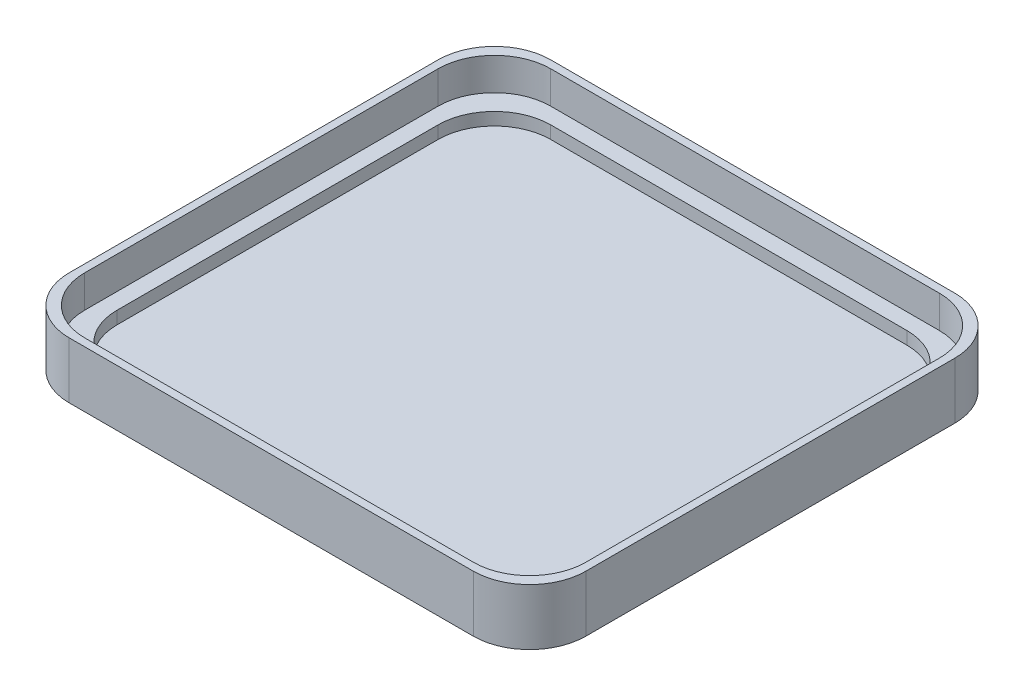
ISO-10303-21;
HEADER;
FILE_DESCRIPTION(('STEP AP214'),'2;1');
FILE_NAME('part.step','',(''),(''),'','','');
FILE_SCHEMA(('AUTOMOTIVE_DESIGN { 1 0 10303 214 1 1 1 1 }'));
ENDSEC;
DATA;
#1=APPLICATION_CONTEXT('core data for automotive mechanical design processes');
#2=APPLICATION_PROTOCOL_DEFINITION('international standard','automotive_design',2000,#1);
#3=PRODUCT_CONTEXT('',#1,'mechanical');
#4=PRODUCT('Part','Part','',(#3));
#5=PRODUCT_RELATED_PRODUCT_CATEGORY('part','',(#4));
#6=PRODUCT_DEFINITION_FORMATION('','',#4);
#7=PRODUCT_DEFINITION_CONTEXT('part definition',#1,'design');
#8=PRODUCT_DEFINITION('design','',#6,#7);
#9=PRODUCT_DEFINITION_SHAPE('','',#8);
#10=(LENGTH_UNIT() NAMED_UNIT(*) SI_UNIT(.MILLI.,.METRE.));
#11=(NAMED_UNIT(*) PLANE_ANGLE_UNIT() SI_UNIT($,.RADIAN.));
#12=(NAMED_UNIT(*) SI_UNIT($,.STERADIAN.) SOLID_ANGLE_UNIT());
#13=UNCERTAINTY_MEASURE_WITH_UNIT(LENGTH_MEASURE(1.E-05),#10,'distance_accuracy_value','');
#14=(GEOMETRIC_REPRESENTATION_CONTEXT(3) GLOBAL_UNCERTAINTY_ASSIGNED_CONTEXT((#13)) GLOBAL_UNIT_ASSIGNED_CONTEXT((#10,
#11,#12)) REPRESENTATION_CONTEXT('',''));
#15=CARTESIAN_POINT('',(0.,0.,0.));
#16=DIRECTION('',(0.,0.,1.));
#17=DIRECTION('',(1.,0.,0.));
#18=AXIS2_PLACEMENT_3D('',#15,#16,#17);
#19=CARTESIAN_POINT('',(0.,4.318,0.));
#20=DIRECTION('',(0.,-1.,0.));
#21=DIRECTION('',(0.,0.,-1.));
#22=AXIS2_PLACEMENT_3D('',#19,#20,#21);
#23=PLANE('',#22);
#24=DIRECTION('',(0.,0.,1.));
#25=VECTOR('',#24,1.);
#26=CARTESIAN_POINT('',(-45.212,4.318,42.037));
#27=LINE('',#26,#25);
#28=CARTESIAN_POINT('',(-45.212,4.318,-31.877));
#29=VERTEX_POINT('',#28);
#30=CARTESIAN_POINT('',(-45.212,4.318,31.877));
#31=VERTEX_POINT('',#30);
#32=EDGE_CURVE('E466',#29,#31,#27,.T.);
#33=ORIENTED_EDGE('',*,*,#32,.T.);
#34=CARTESIAN_POINT('',(-35.052,4.318,31.877));
#35=DIRECTION('',(0.,-1.,0.));
#36=DIRECTION('',(0.,0.,-1.));
#37=AXIS2_PLACEMENT_3D('',#34,#35,#36);
#38=CIRCLE('',#37,10.16);
#39=CARTESIAN_POINT('',(-35.052,4.318,42.037));
#40=VERTEX_POINT('',#39);
#41=EDGE_CURVE('E345',#31,#40,#38,.F.);
#42=ORIENTED_EDGE('',*,*,#41,.T.);
#43=DIRECTION('',(1.,0.,0.));
#44=VECTOR('',#43,1.);
#45=CARTESIAN_POINT('',(-45.212,4.318,42.037));
#46=LINE('',#45,#44);
#47=CARTESIAN_POINT('',(35.052,4.318,42.037));
#48=VERTEX_POINT('',#47);
#49=EDGE_CURVE('E218',#40,#48,#46,.T.);
#50=ORIENTED_EDGE('',*,*,#49,.T.);
#51=CARTESIAN_POINT('',(35.052,4.318,31.877));
#52=DIRECTION('',(0.,-1.,0.));
#53=DIRECTION('',(0.,0.,-1.));
#54=AXIS2_PLACEMENT_3D('',#51,#52,#53);
#55=CIRCLE('',#54,10.16);
#56=CARTESIAN_POINT('',(45.212,4.318,31.877));
#57=VERTEX_POINT('',#56);
#58=EDGE_CURVE('E343',#48,#57,#55,.F.);
#59=ORIENTED_EDGE('',*,*,#58,.T.);
#60=DIRECTION('',(0.,0.,-1.));
#61=VECTOR('',#60,1.);
#62=CARTESIAN_POINT('',(45.212,4.318,42.037));
#63=LINE('',#62,#61);
#64=CARTESIAN_POINT('',(45.212,4.318,-31.877));
#65=VERTEX_POINT('',#64);
#66=EDGE_CURVE('E227',#57,#65,#63,.T.);
#67=ORIENTED_EDGE('',*,*,#66,.T.);
#68=CARTESIAN_POINT('',(35.052,4.318,-31.877));
#69=DIRECTION('',(0.,-1.,0.));
#70=DIRECTION('',(0.,0.,-1.));
#71=AXIS2_PLACEMENT_3D('',#68,#69,#70);
#72=CIRCLE('',#71,10.16);
#73=CARTESIAN_POINT('',(35.052,4.318,-42.037));
#74=VERTEX_POINT('',#73);
#75=EDGE_CURVE('E341',#65,#74,#72,.F.);
#76=ORIENTED_EDGE('',*,*,#75,.T.);
#77=DIRECTION('',(-1.,0.,0.));
#78=VECTOR('',#77,1.);
#79=CARTESIAN_POINT('',(-45.212,4.318,-42.037));
#80=LINE('',#79,#78);
#81=CARTESIAN_POINT('',(-35.052,4.318,-42.037));
#82=VERTEX_POINT('',#81);
#83=EDGE_CURVE('E231',#74,#82,#80,.T.);
#84=ORIENTED_EDGE('',*,*,#83,.T.);
#85=CARTESIAN_POINT('',(-35.052,4.318,-31.877));
#86=DIRECTION('',(0.,-1.,0.));
#87=DIRECTION('',(0.,0.,-1.));
#88=AXIS2_PLACEMENT_3D('',#85,#86,#87);
#89=CIRCLE('',#88,10.16);
#90=EDGE_CURVE('E339',#82,#29,#89,.F.);
#91=ORIENTED_EDGE('',*,*,#90,.T.);
#92=EDGE_LOOP('',(#33,#42,#50,#59,#67,#76,#84,#91));
#93=FACE_BOUND('',#92,.T.);
#94=DIRECTION('',(0.,0.,-1.));
#95=VECTOR('',#94,1.);
#96=CARTESIAN_POINT('',(42.291,4.318,39.116));
#97=LINE('',#96,#95);
#98=CARTESIAN_POINT('',(42.291,4.318,28.956));
#99=VERTEX_POINT('',#98);
#100=CARTESIAN_POINT('',(42.291,4.318,-28.956));
#101=VERTEX_POINT('',#100);
#102=EDGE_CURVE('E509',#99,#101,#97,.T.);
#103=ORIENTED_EDGE('',*,*,#102,.F.);
#104=CARTESIAN_POINT('',(32.131,4.318,28.956));
#105=DIRECTION('',(0.,-1.,0.));
#106=DIRECTION('',(0.,0.,-1.));
#107=AXIS2_PLACEMENT_3D('',#104,#105,#106);
#108=CIRCLE('',#107,10.16);
#109=CARTESIAN_POINT('',(32.131,4.318,39.116));
#110=VERTEX_POINT('',#109);
#111=EDGE_CURVE('E330',#99,#110,#108,.T.);
#112=ORIENTED_EDGE('',*,*,#111,.T.);
#113=DIRECTION('',(1.,0.,0.));
#114=VECTOR('',#113,1.);
#115=CARTESIAN_POINT('',(-42.291,4.318,39.116));
#116=LINE('',#115,#114);
#117=CARTESIAN_POINT('',(-32.131,4.318,39.116));
#118=VERTEX_POINT('',#117);
#119=EDGE_CURVE('E504',#118,#110,#116,.T.);
#120=ORIENTED_EDGE('',*,*,#119,.F.);
#121=CARTESIAN_POINT('',(-32.131,4.318,28.956));
#122=DIRECTION('',(0.,-1.,0.));
#123=DIRECTION('',(0.,0.,-1.));
#124=AXIS2_PLACEMENT_3D('',#121,#122,#123);
#125=CIRCLE('',#124,10.16);
#126=CARTESIAN_POINT('',(-42.291,4.318,28.956));
#127=VERTEX_POINT('',#126);
#128=EDGE_CURVE('E208',#118,#127,#125,.T.);
#129=ORIENTED_EDGE('',*,*,#128,.T.);
#130=DIRECTION('',(0.,0.,1.));
#131=VECTOR('',#130,1.);
#132=CARTESIAN_POINT('',(-42.291,4.318,39.116));
#133=LINE('',#132,#131);
#134=CARTESIAN_POINT('',(-42.291,4.318,-28.956));
#135=VERTEX_POINT('',#134);
#136=EDGE_CURVE('E514',#135,#127,#133,.T.);
#137=ORIENTED_EDGE('',*,*,#136,.F.);
#138=CARTESIAN_POINT('',(-32.131,4.318,-28.956));
#139=DIRECTION('',(0.,-1.,0.));
#140=DIRECTION('',(0.,0.,-1.));
#141=AXIS2_PLACEMENT_3D('',#138,#139,#140);
#142=CIRCLE('',#141,10.16);
#143=CARTESIAN_POINT('',(-32.131,4.318,-39.116));
#144=VERTEX_POINT('',#143);
#145=EDGE_CURVE('E51',#135,#144,#142,.T.);
#146=ORIENTED_EDGE('',*,*,#145,.T.);
#147=DIRECTION('',(-1.,0.,0.));
#148=VECTOR('',#147,1.);
#149=CARTESIAN_POINT('',(-42.291,4.318,-39.116));
#150=LINE('',#149,#148);
#151=CARTESIAN_POINT('',(32.131,4.318,-39.116));
#152=VERTEX_POINT('',#151);
#153=EDGE_CURVE('E512',#152,#144,#150,.T.);
#154=ORIENTED_EDGE('',*,*,#153,.F.);
#155=CARTESIAN_POINT('',(32.131,4.318,-28.956));
#156=DIRECTION('',(0.,-1.,0.));
#157=DIRECTION('',(0.,0.,-1.));
#158=AXIS2_PLACEMENT_3D('',#155,#156,#157);
#159=CIRCLE('',#158,10.16);
#160=EDGE_CURVE('E59',#152,#101,#159,.T.);
#161=ORIENTED_EDGE('',*,*,#160,.T.);
#162=EDGE_LOOP('',(#103,#112,#120,#129,#137,#146,#154,#161));
#163=FACE_BOUND('',#162,.T.);
#164=ADVANCED_FACE('F36',(#93,#163),#23,.F.);
#165=CARTESIAN_POINT('',(46.609,10.16,43.434));
#166=DIRECTION('',(-1.,0.,0.));
#167=DIRECTION('',(0.,0.,1.));
#168=AXIS2_PLACEMENT_3D('',#165,#166,#167);
#169=PLANE('',#168);
#170=DIRECTION('',(0.,0.,-1.));
#171=VECTOR('',#170,1.);
#172=CARTESIAN_POINT('',(46.609,10.16,43.434));
#173=LINE('',#172,#171);
#174=CARTESIAN_POINT('',(46.609,10.16,33.274));
#175=VERTEX_POINT('',#174);
#176=CARTESIAN_POINT('',(46.609,10.16,-33.274));
#177=VERTEX_POINT('',#176);
#178=EDGE_CURVE('E237',#175,#177,#173,.T.);
#179=ORIENTED_EDGE('',*,*,#178,.F.);
#180=DIRECTION('',(0.,-1.,0.));
#181=VECTOR('',#180,1.);
#182=CARTESIAN_POINT('',(46.609,10.16,33.274));
#183=LINE('',#182,#181);
#184=CARTESIAN_POINT('',(46.609,0.,33.274));
#185=VERTEX_POINT('',#184);
#186=EDGE_CURVE('E313',#175,#185,#183,.T.);
#187=ORIENTED_EDGE('',*,*,#186,.T.);
#188=DIRECTION('',(0.,0.,-1.));
#189=VECTOR('',#188,1.);
#190=CARTESIAN_POINT('',(46.609,0.,43.434));
#191=LINE('',#190,#189);
#192=CARTESIAN_POINT('',(46.609,0.,-33.274));
#193=VERTEX_POINT('',#192);
#194=EDGE_CURVE('E250',#185,#193,#191,.T.);
#195=ORIENTED_EDGE('',*,*,#194,.T.);
#196=DIRECTION('',(0.,-1.,0.));
#197=VECTOR('',#196,1.);
#198=CARTESIAN_POINT('',(46.609,10.16,-33.274));
#199=LINE('',#198,#197);
#200=EDGE_CURVE('E311',#193,#177,#199,.F.);
#201=ORIENTED_EDGE('',*,*,#200,.T.);
#202=EDGE_LOOP('',(#179,#187,#195,#201));
#203=FACE_BOUND('',#202,.T.);
#204=ADVANCED_FACE('F358',(#203),#169,.F.);
#205=CARTESIAN_POINT('',(-46.609,10.16,-43.434));
#206=DIRECTION('',(0.,0.,1.));
#207=DIRECTION('',(1.,0.,0.));
#208=AXIS2_PLACEMENT_3D('',#205,#206,#207);
#209=PLANE('',#208);
#210=DIRECTION('',(-1.,0.,0.));
#211=VECTOR('',#210,1.);
#212=CARTESIAN_POINT('',(-46.609,10.16,-43.434));
#213=LINE('',#212,#211);
#214=CARTESIAN_POINT('',(36.449,10.16,-43.434));
#215=VERTEX_POINT('',#214);
#216=CARTESIAN_POINT('',(-36.449,10.16,-43.434));
#217=VERTEX_POINT('',#216);
#218=EDGE_CURVE('E240',#215,#217,#213,.T.);
#219=ORIENTED_EDGE('',*,*,#218,.F.);
#220=DIRECTION('',(0.,-1.,0.));
#221=VECTOR('',#220,1.);
#222=CARTESIAN_POINT('',(36.449,10.16,-43.434));
#223=LINE('',#222,#221);
#224=CARTESIAN_POINT('',(36.449,0.,-43.434));
#225=VERTEX_POINT('',#224);
#226=EDGE_CURVE('E318',#215,#225,#223,.T.);
#227=ORIENTED_EDGE('',*,*,#226,.T.);
#228=DIRECTION('',(-1.,0.,0.));
#229=VECTOR('',#228,1.);
#230=CARTESIAN_POINT('',(-46.609,0.,-43.434));
#231=LINE('',#230,#229);
#232=CARTESIAN_POINT('',(-36.449,0.,-43.434));
#233=VERTEX_POINT('',#232);
#234=EDGE_CURVE('E253',#225,#233,#231,.T.);
#235=ORIENTED_EDGE('',*,*,#234,.T.);
#236=DIRECTION('',(0.,-1.,0.));
#237=VECTOR('',#236,1.);
#238=CARTESIAN_POINT('',(-36.449,10.16,-43.434));
#239=LINE('',#238,#237);
#240=EDGE_CURVE('E316',#233,#217,#239,.F.);
#241=ORIENTED_EDGE('',*,*,#240,.T.);
#242=EDGE_LOOP('',(#219,#227,#235,#241));
#243=FACE_BOUND('',#242,.T.);
#244=ADVANCED_FACE('F384',(#243),#209,.F.);
#245=CARTESIAN_POINT('',(-46.609,10.16,43.434));
#246=DIRECTION('',(1.,0.,0.));
#247=DIRECTION('',(0.,0.,-1.));
#248=AXIS2_PLACEMENT_3D('',#245,#246,#247);
#249=PLANE('',#248);
#250=DIRECTION('',(0.,0.,1.));
#251=VECTOR('',#250,1.);
#252=CARTESIAN_POINT('',(-46.609,0.,43.434));
#253=LINE('',#252,#251);
#254=CARTESIAN_POINT('',(-46.609,0.,-33.274));
#255=VERTEX_POINT('',#254);
#256=CARTESIAN_POINT('',(-46.609,0.,33.274));
#257=VERTEX_POINT('',#256);
#258=EDGE_CURVE('E256',#255,#257,#253,.T.);
#259=ORIENTED_EDGE('',*,*,#258,.T.);
#260=DIRECTION('',(0.,-1.,0.));
#261=VECTOR('',#260,1.);
#262=CARTESIAN_POINT('',(-46.609,10.16,33.274));
#263=LINE('',#262,#261);
#264=CARTESIAN_POINT('',(-46.609,10.16,33.274));
#265=VERTEX_POINT('',#264);
#266=EDGE_CURVE('E299',#257,#265,#263,.F.);
#267=ORIENTED_EDGE('',*,*,#266,.T.);
#268=DIRECTION('',(0.,0.,1.));
#269=VECTOR('',#268,1.);
#270=CARTESIAN_POINT('',(-46.609,10.16,43.434));
#271=LINE('',#270,#269);
#272=CARTESIAN_POINT('',(-46.609,10.16,-33.274));
#273=VERTEX_POINT('',#272);
#274=EDGE_CURVE('E244',#273,#265,#271,.T.);
#275=ORIENTED_EDGE('',*,*,#274,.F.);
#276=DIRECTION('',(0.,-1.,0.));
#277=VECTOR('',#276,1.);
#278=CARTESIAN_POINT('',(-46.609,10.16,-33.274));
#279=LINE('',#278,#277);
#280=EDGE_CURVE('E296',#273,#255,#279,.T.);
#281=ORIENTED_EDGE('',*,*,#280,.T.);
#282=EDGE_LOOP('',(#259,#267,#275,#281));
#283=FACE_BOUND('',#282,.T.);
#284=ADVANCED_FACE('F374',(#283),#249,.F.);
#285=CARTESIAN_POINT('',(-46.609,10.16,43.434));
#286=DIRECTION('',(0.,0.,-1.));
#287=DIRECTION('',(-1.,0.,0.));
#288=AXIS2_PLACEMENT_3D('',#285,#286,#287);
#289=PLANE('',#288);
#290=DIRECTION('',(1.,0.,0.));
#291=VECTOR('',#290,1.);
#292=CARTESIAN_POINT('',(-46.609,10.16,43.434));
#293=LINE('',#292,#291);
#294=CARTESIAN_POINT('',(-36.449,10.16,43.434));
#295=VERTEX_POINT('',#294);
#296=CARTESIAN_POINT('',(36.449,10.16,43.434));
#297=VERTEX_POINT('',#296);
#298=EDGE_CURVE('E247',#295,#297,#293,.T.);
#299=ORIENTED_EDGE('',*,*,#298,.F.);
#300=DIRECTION('',(0.,-1.,0.));
#301=VECTOR('',#300,1.);
#302=CARTESIAN_POINT('',(-36.449,10.16,43.434));
#303=LINE('',#302,#301);
#304=CARTESIAN_POINT('',(-36.449,0.,43.434));
#305=VERTEX_POINT('',#304);
#306=EDGE_CURVE('E285',#295,#305,#303,.T.);
#307=ORIENTED_EDGE('',*,*,#306,.T.);
#308=DIRECTION('',(1.,0.,0.));
#309=VECTOR('',#308,1.);
#310=CARTESIAN_POINT('',(-46.609,0.,43.434));
#311=LINE('',#310,#309);
#312=CARTESIAN_POINT('',(36.449,0.,43.434));
#313=VERTEX_POINT('',#312);
#314=EDGE_CURVE('E241',#305,#313,#311,.T.);
#315=ORIENTED_EDGE('',*,*,#314,.T.);
#316=DIRECTION('',(0.,-1.,0.));
#317=VECTOR('',#316,1.);
#318=CARTESIAN_POINT('',(36.449,10.16,43.434));
#319=LINE('',#318,#317);
#320=EDGE_CURVE('E283',#313,#297,#319,.F.);
#321=ORIENTED_EDGE('',*,*,#320,.T.);
#322=EDGE_LOOP('',(#299,#307,#315,#321));
#323=FACE_BOUND('',#322,.T.);
#324=ADVANCED_FACE('F366',(#323),#289,.F.);
#325=CARTESIAN_POINT('',(0.,10.16,0.));
#326=DIRECTION('',(0.,-1.,0.));
#327=DIRECTION('',(0.,0.,-1.));
#328=AXIS2_PLACEMENT_3D('',#325,#326,#327);
#329=PLANE('',#328);
#330=DIRECTION('',(-1.,0.,0.));
#331=VECTOR('',#330,1.);
#332=CARTESIAN_POINT('',(-45.212,10.16,-42.037));
#333=LINE('',#332,#331);
#334=CARTESIAN_POINT('',(35.052,10.16,-42.037));
#335=VERTEX_POINT('',#334);
#336=CARTESIAN_POINT('',(-35.052,10.16,-42.037));
#337=VERTEX_POINT('',#336);
#338=EDGE_CURVE('E233',#335,#337,#333,.T.);
#339=ORIENTED_EDGE('',*,*,#338,.F.);
#340=CARTESIAN_POINT('',(35.052,10.16,-31.877));
#341=DIRECTION('',(0.,-1.,0.));
#342=DIRECTION('',(0.,0.,-1.));
#343=AXIS2_PLACEMENT_3D('',#340,#341,#342);
#344=CIRCLE('',#343,10.16);
#345=CARTESIAN_POINT('',(45.212,10.16,-31.877));
#346=VERTEX_POINT('',#345);
#347=EDGE_CURVE('E333',#335,#346,#344,.T.);
#348=ORIENTED_EDGE('',*,*,#347,.T.);
#349=DIRECTION('',(0.,0.,-1.));
#350=VECTOR('',#349,1.);
#351=CARTESIAN_POINT('',(45.212,10.16,42.037));
#352=LINE('',#351,#350);
#353=CARTESIAN_POINT('',(45.212,10.16,31.877));
#354=VERTEX_POINT('',#353);
#355=EDGE_CURVE('E459',#354,#346,#352,.T.);
#356=ORIENTED_EDGE('',*,*,#355,.F.);
#357=CARTESIAN_POINT('',(35.052,10.16,31.877));
#358=DIRECTION('',(0.,-1.,0.));
#359=DIRECTION('',(0.,0.,-1.));
#360=AXIS2_PLACEMENT_3D('',#357,#358,#359);
#361=CIRCLE('',#360,10.16);
#362=CARTESIAN_POINT('',(35.052,10.16,42.037));
#363=VERTEX_POINT('',#362);
#364=EDGE_CURVE('E226',#354,#363,#361,.T.);
#365=ORIENTED_EDGE('',*,*,#364,.T.);
#366=DIRECTION('',(1.,0.,0.));
#367=VECTOR('',#366,1.);
#368=CARTESIAN_POINT('',(-45.212,10.16,42.037));
#369=LINE('',#368,#367);
#370=CARTESIAN_POINT('',(-35.052,10.16,42.037));
#371=VERTEX_POINT('',#370);
#372=EDGE_CURVE('E215',#371,#363,#369,.T.);
#373=ORIENTED_EDGE('',*,*,#372,.F.);
#374=CARTESIAN_POINT('',(-35.052,10.16,31.877));
#375=DIRECTION('',(0.,-1.,0.));
#376=DIRECTION('',(0.,0.,-1.));
#377=AXIS2_PLACEMENT_3D('',#374,#375,#376);
#378=CIRCLE('',#377,10.16);
#379=CARTESIAN_POINT('',(-45.212,10.16,31.877));
#380=VERTEX_POINT('',#379);
#381=EDGE_CURVE('E198',#371,#380,#378,.T.);
#382=ORIENTED_EDGE('',*,*,#381,.T.);
#383=DIRECTION('',(0.,0.,1.));
#384=VECTOR('',#383,1.);
#385=CARTESIAN_POINT('',(-45.212,10.16,42.037));
#386=LINE('',#385,#384);
#387=CARTESIAN_POINT('',(-45.212,10.16,-31.877));
#388=VERTEX_POINT('',#387);
#389=EDGE_CURVE('E228',#388,#380,#386,.T.);
#390=ORIENTED_EDGE('',*,*,#389,.F.);
#391=CARTESIAN_POINT('',(-35.052,10.16,-31.877));
#392=DIRECTION('',(0.,-1.,0.));
#393=DIRECTION('',(0.,0.,-1.));
#394=AXIS2_PLACEMENT_3D('',#391,#392,#393);
#395=CIRCLE('',#394,10.16);
#396=EDGE_CURVE('E336',#388,#337,#395,.T.);
#397=ORIENTED_EDGE('',*,*,#396,.T.);
#398=EDGE_LOOP('',(#339,#348,#356,#365,#373,#382,#390,#397));
#399=FACE_BOUND('',#398,.T.);
#400=ORIENTED_EDGE('',*,*,#274,.T.);
#401=CARTESIAN_POINT('',(-36.449,10.16,33.274));
#402=DIRECTION('',(0.,-1.,0.));
#403=DIRECTION('',(0.,0.,-1.));
#404=AXIS2_PLACEMENT_3D('',#401,#402,#403);
#405=CIRCLE('',#404,10.16);
#406=EDGE_CURVE('E11',#265,#295,#405,.F.);
#407=ORIENTED_EDGE('',*,*,#406,.T.);
#408=ORIENTED_EDGE('',*,*,#298,.T.);
#409=CARTESIAN_POINT('',(36.449,10.16,33.274));
#410=DIRECTION('',(0.,-1.,0.));
#411=DIRECTION('',(0.,0.,-1.));
#412=AXIS2_PLACEMENT_3D('',#409,#410,#411);
#413=CIRCLE('',#412,10.16);
#414=EDGE_CURVE('E44',#297,#175,#413,.F.);
#415=ORIENTED_EDGE('',*,*,#414,.T.);
#416=ORIENTED_EDGE('',*,*,#178,.T.);
#417=CARTESIAN_POINT('',(36.449,10.16,-33.274));
#418=DIRECTION('',(0.,-1.,0.));
#419=DIRECTION('',(0.,0.,-1.));
#420=AXIS2_PLACEMENT_3D('',#417,#418,#419);
#421=CIRCLE('',#420,10.16);
#422=EDGE_CURVE('E349',#177,#215,#421,.F.);
#423=ORIENTED_EDGE('',*,*,#422,.T.);
#424=ORIENTED_EDGE('',*,*,#218,.T.);
#425=CARTESIAN_POINT('',(-36.449,10.16,-33.274));
#426=DIRECTION('',(0.,-1.,0.));
#427=DIRECTION('',(0.,0.,-1.));
#428=AXIS2_PLACEMENT_3D('',#425,#426,#427);
#429=CIRCLE('',#428,10.16);
#430=EDGE_CURVE('E347',#217,#273,#429,.F.);
#431=ORIENTED_EDGE('',*,*,#430,.T.);
#432=EDGE_LOOP('',(#400,#407,#408,#415,#416,#423,#424,#431));
#433=FACE_BOUND('',#432,.T.);
#434=ADVANCED_FACE('F223',(#399,#433),#329,.F.);
#435=CARTESIAN_POINT('',(0.,0.,0.));
#436=DIRECTION('',(0.,-1.,0.));
#437=DIRECTION('',(0.,0.,-1.));
#438=AXIS2_PLACEMENT_3D('',#435,#436,#437);
#439=PLANE('',#438);
#440=ORIENTED_EDGE('',*,*,#314,.F.);
#441=CARTESIAN_POINT('',(-36.449,0.,33.274));
#442=DIRECTION('',(0.,-1.,0.));
#443=DIRECTION('',(0.,0.,-1.));
#444=AXIS2_PLACEMENT_3D('',#441,#442,#443);
#445=CIRCLE('',#444,10.16);
#446=EDGE_CURVE('E294',#305,#257,#445,.T.);
#447=ORIENTED_EDGE('',*,*,#446,.T.);
#448=ORIENTED_EDGE('',*,*,#258,.F.);
#449=CARTESIAN_POINT('',(-36.449,0.,-33.274));
#450=DIRECTION('',(0.,-1.,0.));
#451=DIRECTION('',(0.,0.,-1.));
#452=AXIS2_PLACEMENT_3D('',#449,#450,#451);
#453=CIRCLE('',#452,10.16);
#454=EDGE_CURVE('E288',#255,#233,#453,.T.);
#455=ORIENTED_EDGE('',*,*,#454,.T.);
#456=ORIENTED_EDGE('',*,*,#234,.F.);
#457=CARTESIAN_POINT('',(36.449,0.,-33.274));
#458=DIRECTION('',(0.,-1.,0.));
#459=DIRECTION('',(0.,0.,-1.));
#460=AXIS2_PLACEMENT_3D('',#457,#458,#459);
#461=CIRCLE('',#460,10.16);
#462=EDGE_CURVE('E290',#225,#193,#461,.T.);
#463=ORIENTED_EDGE('',*,*,#462,.T.);
#464=ORIENTED_EDGE('',*,*,#194,.F.);
#465=CARTESIAN_POINT('',(36.449,0.,33.274));
#466=DIRECTION('',(0.,-1.,0.));
#467=DIRECTION('',(0.,0.,-1.));
#468=AXIS2_PLACEMENT_3D('',#465,#466,#467);
#469=CIRCLE('',#468,10.16);
#470=EDGE_CURVE('E292',#185,#313,#469,.T.);
#471=ORIENTED_EDGE('',*,*,#470,.T.);
#472=EDGE_LOOP('',(#440,#447,#448,#455,#456,#463,#464,#471));
#473=FACE_BOUND('',#472,.T.);
#474=ADVANCED_FACE('F364',(#473),#439,.T.);
#475=CARTESIAN_POINT('',(45.212,4.318,42.037));
#476=DIRECTION('',(1.,0.,0.));
#477=DIRECTION('',(0.,0.,-1.));
#478=AXIS2_PLACEMENT_3D('',#475,#476,#477);
#479=PLANE('',#478);
#480=ORIENTED_EDGE('',*,*,#66,.F.);
#481=DIRECTION('',(0.,1.,0.));
#482=VECTOR('',#481,1.);
#483=CARTESIAN_POINT('',(45.212,10.16,31.877));
#484=LINE('',#483,#482);
#485=EDGE_CURVE('E308',#57,#354,#484,.T.);
#486=ORIENTED_EDGE('',*,*,#485,.T.);
#487=ORIENTED_EDGE('',*,*,#355,.T.);
#488=DIRECTION('',(0.,1.,0.));
#489=VECTOR('',#488,1.);
#490=CARTESIAN_POINT('',(45.212,4.318,-31.877));
#491=LINE('',#490,#489);
#492=EDGE_CURVE('E306',#346,#65,#491,.F.);
#493=ORIENTED_EDGE('',*,*,#492,.T.);
#494=EDGE_LOOP('',(#480,#486,#487,#493));
#495=FACE_BOUND('',#494,.T.);
#496=ADVANCED_FACE('F415',(#495),#479,.F.);
#497=CARTESIAN_POINT('',(-45.212,4.318,42.037));
#498=DIRECTION('',(0.,0.,1.));
#499=DIRECTION('',(1.,0.,0.));
#500=AXIS2_PLACEMENT_3D('',#497,#498,#499);
#501=PLANE('',#500);
#502=ORIENTED_EDGE('',*,*,#49,.F.);
#503=DIRECTION('',(0.,1.,0.));
#504=VECTOR('',#503,1.);
#505=CARTESIAN_POINT('',(-35.052,10.16,42.037));
#506=LINE('',#505,#504);
#507=EDGE_CURVE('E202',#40,#371,#506,.T.);
#508=ORIENTED_EDGE('',*,*,#507,.T.);
#509=ORIENTED_EDGE('',*,*,#372,.T.);
#510=DIRECTION('',(0.,1.,0.));
#511=VECTOR('',#510,1.);
#512=CARTESIAN_POINT('',(35.052,4.318,42.037));
#513=LINE('',#512,#511);
#514=EDGE_CURVE('E220',#363,#48,#513,.F.);
#515=ORIENTED_EDGE('',*,*,#514,.T.);
#516=EDGE_LOOP('',(#502,#508,#509,#515));
#517=FACE_BOUND('',#516,.T.);
#518=ADVANCED_FACE('F214',(#517),#501,.F.);
#519=CARTESIAN_POINT('',(-45.212,4.318,42.037));
#520=DIRECTION('',(-1.,0.,0.));
#521=DIRECTION('',(0.,0.,1.));
#522=AXIS2_PLACEMENT_3D('',#519,#520,#521);
#523=PLANE('',#522);
#524=ORIENTED_EDGE('',*,*,#389,.T.);
#525=DIRECTION('',(0.,1.,0.));
#526=VECTOR('',#525,1.);
#527=CARTESIAN_POINT('',(-45.212,4.318,31.877));
#528=LINE('',#527,#526);
#529=EDGE_CURVE('E203',#380,#31,#528,.F.);
#530=ORIENTED_EDGE('',*,*,#529,.T.);
#531=ORIENTED_EDGE('',*,*,#32,.F.);
#532=DIRECTION('',(0.,1.,0.));
#533=VECTOR('',#532,1.);
#534=CARTESIAN_POINT('',(-45.212,10.16,-31.877));
#535=LINE('',#534,#533);
#536=EDGE_CURVE('E219',#29,#388,#535,.T.);
#537=ORIENTED_EDGE('',*,*,#536,.T.);
#538=EDGE_LOOP('',(#524,#530,#531,#537));
#539=FACE_BOUND('',#538,.T.);
#540=ADVANCED_FACE('F414',(#539),#523,.F.);
#541=CARTESIAN_POINT('',(-45.212,4.318,-42.037));
#542=DIRECTION('',(0.,0.,-1.));
#543=DIRECTION('',(-1.,0.,0.));
#544=AXIS2_PLACEMENT_3D('',#541,#542,#543);
#545=PLANE('',#544);
#546=ORIENTED_EDGE('',*,*,#83,.F.);
#547=DIRECTION('',(0.,1.,0.));
#548=VECTOR('',#547,1.);
#549=CARTESIAN_POINT('',(35.052,10.16,-42.037));
#550=LINE('',#549,#548);
#551=EDGE_CURVE('E323',#74,#335,#550,.T.);
#552=ORIENTED_EDGE('',*,*,#551,.T.);
#553=ORIENTED_EDGE('',*,*,#338,.T.);
#554=DIRECTION('',(0.,1.,0.));
#555=VECTOR('',#554,1.);
#556=CARTESIAN_POINT('',(-35.052,4.318,-42.037));
#557=LINE('',#556,#555);
#558=EDGE_CURVE('E321',#337,#82,#557,.F.);
#559=ORIENTED_EDGE('',*,*,#558,.T.);
#560=EDGE_LOOP('',(#546,#552,#553,#559));
#561=FACE_BOUND('',#560,.T.);
#562=ADVANCED_FACE('F418',(#561),#545,.F.);
#563=CARTESIAN_POINT('',(42.291,2.032,39.116));
#564=DIRECTION('',(1.,0.,0.));
#565=DIRECTION('',(0.,0.,-1.));
#566=AXIS2_PLACEMENT_3D('',#563,#564,#565);
#567=PLANE('',#566);
#568=DIRECTION('',(0.,0.,-1.));
#569=VECTOR('',#568,1.);
#570=CARTESIAN_POINT('',(42.291,2.032,39.116));
#571=LINE('',#570,#569);
#572=CARTESIAN_POINT('',(42.291,2.032,28.956));
#573=VERTEX_POINT('',#572);
#574=CARTESIAN_POINT('',(42.291,2.032,-28.956));
#575=VERTEX_POINT('',#574);
#576=EDGE_CURVE('E497',#573,#575,#571,.T.);
#577=ORIENTED_EDGE('',*,*,#576,.F.);
#578=DIRECTION('',(0.,1.,0.));
#579=VECTOR('',#578,1.);
#580=CARTESIAN_POINT('',(42.291,4.318,28.956));
#581=LINE('',#580,#579);
#582=EDGE_CURVE('E303',#573,#99,#581,.T.);
#583=ORIENTED_EDGE('',*,*,#582,.T.);
#584=ORIENTED_EDGE('',*,*,#102,.T.);
#585=DIRECTION('',(0.,1.,0.));
#586=VECTOR('',#585,1.);
#587=CARTESIAN_POINT('',(42.291,2.032,-28.956));
#588=LINE('',#587,#586);
#589=EDGE_CURVE('E301',#101,#575,#588,.F.);
#590=ORIENTED_EDGE('',*,*,#589,.T.);
#591=EDGE_LOOP('',(#577,#583,#584,#590));
#592=FACE_BOUND('',#591,.T.);
#593=ADVANCED_FACE('F410',(#592),#567,.F.);
#594=CARTESIAN_POINT('',(-42.291,2.032,39.116));
#595=DIRECTION('',(0.,0.,1.));
#596=DIRECTION('',(1.,0.,0.));
#597=AXIS2_PLACEMENT_3D('',#594,#595,#596);
#598=PLANE('',#597);
#599=DIRECTION('',(1.,0.,0.));
#600=VECTOR('',#599,1.);
#601=CARTESIAN_POINT('',(-42.291,2.032,39.116));
#602=LINE('',#601,#600);
#603=CARTESIAN_POINT('',(-32.131,2.032,39.116));
#604=VERTEX_POINT('',#603);
#605=CARTESIAN_POINT('',(32.131,2.032,39.116));
#606=VERTEX_POINT('',#605);
#607=EDGE_CURVE('E472',#604,#606,#602,.T.);
#608=ORIENTED_EDGE('',*,*,#607,.F.);
#609=DIRECTION('',(0.,1.,0.));
#610=VECTOR('',#609,1.);
#611=CARTESIAN_POINT('',(-32.131,4.318,39.116));
#612=LINE('',#611,#610);
#613=EDGE_CURVE('E267',#604,#118,#612,.T.);
#614=ORIENTED_EDGE('',*,*,#613,.T.);
#615=ORIENTED_EDGE('',*,*,#119,.T.);
#616=DIRECTION('',(0.,1.,0.));
#617=VECTOR('',#616,1.);
#618=CARTESIAN_POINT('',(32.131,2.032,39.116));
#619=LINE('',#618,#617);
#620=EDGE_CURVE('E265',#110,#606,#619,.F.);
#621=ORIENTED_EDGE('',*,*,#620,.T.);
#622=EDGE_LOOP('',(#608,#614,#615,#621));
#623=FACE_BOUND('',#622,.T.);
#624=ADVANCED_FACE('F521',(#623),#598,.F.);
#625=CARTESIAN_POINT('',(-42.291,2.032,39.116));
#626=DIRECTION('',(-1.,0.,0.));
#627=DIRECTION('',(0.,0.,1.));
#628=AXIS2_PLACEMENT_3D('',#625,#626,#627);
#629=PLANE('',#628);
#630=ORIENTED_EDGE('',*,*,#136,.T.);
#631=DIRECTION('',(0.,1.,0.));
#632=VECTOR('',#631,1.);
#633=CARTESIAN_POINT('',(-42.291,2.032,28.956));
#634=LINE('',#633,#632);
#635=CARTESIAN_POINT('',(-42.291,2.032,28.956));
#636=VERTEX_POINT('',#635);
#637=EDGE_CURVE('E273',#127,#636,#634,.F.);
#638=ORIENTED_EDGE('',*,*,#637,.T.);
#639=DIRECTION('',(0.,0.,1.));
#640=VECTOR('',#639,1.);
#641=CARTESIAN_POINT('',(-42.291,2.032,39.116));
#642=LINE('',#641,#640);
#643=CARTESIAN_POINT('',(-42.291,2.032,-28.956));
#644=VERTEX_POINT('',#643);
#645=EDGE_CURVE('E501',#644,#636,#642,.T.);
#646=ORIENTED_EDGE('',*,*,#645,.F.);
#647=DIRECTION('',(0.,1.,0.));
#648=VECTOR('',#647,1.);
#649=CARTESIAN_POINT('',(-42.291,4.318,-28.956));
#650=LINE('',#649,#648);
#651=EDGE_CURVE('E270',#644,#135,#650,.T.);
#652=ORIENTED_EDGE('',*,*,#651,.T.);
#653=EDGE_LOOP('',(#630,#638,#646,#652));
#654=FACE_BOUND('',#653,.T.);
#655=ADVANCED_FACE('F531',(#654),#629,.F.);
#656=CARTESIAN_POINT('',(-42.291,2.032,-39.116));
#657=DIRECTION('',(0.,0.,-1.));
#658=DIRECTION('',(-1.,0.,0.));
#659=AXIS2_PLACEMENT_3D('',#656,#657,#658);
#660=PLANE('',#659);
#661=DIRECTION('',(-1.,0.,0.));
#662=VECTOR('',#661,1.);
#663=CARTESIAN_POINT('',(-42.291,2.032,-39.116));
#664=LINE('',#663,#662);
#665=CARTESIAN_POINT('',(32.131,2.032,-39.116));
#666=VERTEX_POINT('',#665);
#667=CARTESIAN_POINT('',(-32.131,2.032,-39.116));
#668=VERTEX_POINT('',#667);
#669=EDGE_CURVE('E494',#666,#668,#664,.T.);
#670=ORIENTED_EDGE('',*,*,#669,.F.);
#671=DIRECTION('',(0.,1.,0.));
#672=VECTOR('',#671,1.);
#673=CARTESIAN_POINT('',(32.131,4.318,-39.116));
#674=LINE('',#673,#672);
#675=EDGE_CURVE('E209',#666,#152,#674,.T.);
#676=ORIENTED_EDGE('',*,*,#675,.T.);
#677=ORIENTED_EDGE('',*,*,#153,.T.);
#678=DIRECTION('',(0.,1.,0.));
#679=VECTOR('',#678,1.);
#680=CARTESIAN_POINT('',(-32.131,2.032,-39.116));
#681=LINE('',#680,#679);
#682=EDGE_CURVE('E326',#144,#668,#681,.F.);
#683=ORIENTED_EDGE('',*,*,#682,.T.);
#684=EDGE_LOOP('',(#670,#676,#677,#683));
#685=FACE_BOUND('',#684,.T.);
#686=ADVANCED_FACE('F499',(#685),#660,.F.);
#687=CARTESIAN_POINT('',(0.,2.032,0.));
#688=DIRECTION('',(0.,-1.,0.));
#689=DIRECTION('',(0.,0.,-1.));
#690=AXIS2_PLACEMENT_3D('',#687,#688,#689);
#691=PLANE('',#690);
#692=ORIENTED_EDGE('',*,*,#645,.T.);
#693=CARTESIAN_POINT('',(-32.131,2.032,28.956));
#694=DIRECTION('',(0.,-1.,0.));
#695=DIRECTION('',(0.,0.,-1.));
#696=AXIS2_PLACEMENT_3D('',#693,#694,#695);
#697=CIRCLE('',#696,10.16);
#698=EDGE_CURVE('E281',#636,#604,#697,.F.);
#699=ORIENTED_EDGE('',*,*,#698,.T.);
#700=ORIENTED_EDGE('',*,*,#607,.T.);
#701=CARTESIAN_POINT('',(32.131,2.032,28.956));
#702=DIRECTION('',(0.,-1.,0.));
#703=DIRECTION('',(0.,0.,-1.));
#704=AXIS2_PLACEMENT_3D('',#701,#702,#703);
#705=CIRCLE('',#704,10.16);
#706=EDGE_CURVE('E279',#606,#573,#705,.F.);
#707=ORIENTED_EDGE('',*,*,#706,.T.);
#708=ORIENTED_EDGE('',*,*,#576,.T.);
#709=CARTESIAN_POINT('',(32.131,2.032,-28.956));
#710=DIRECTION('',(0.,-1.,0.));
#711=DIRECTION('',(0.,0.,-1.));
#712=AXIS2_PLACEMENT_3D('',#709,#710,#711);
#713=CIRCLE('',#712,10.16);
#714=EDGE_CURVE('E277',#575,#666,#713,.F.);
#715=ORIENTED_EDGE('',*,*,#714,.T.);
#716=ORIENTED_EDGE('',*,*,#669,.T.);
#717=CARTESIAN_POINT('',(-32.131,2.032,-28.956));
#718=DIRECTION('',(0.,-1.,0.));
#719=DIRECTION('',(0.,0.,-1.));
#720=AXIS2_PLACEMENT_3D('',#717,#718,#719);
#721=CIRCLE('',#720,10.16);
#722=EDGE_CURVE('E275',#668,#644,#721,.F.);
#723=ORIENTED_EDGE('',*,*,#722,.T.);
#724=EDGE_LOOP('',(#692,#699,#700,#707,#708,#715,#716,#723));
#725=FACE_BOUND('',#724,.T.);
#726=ADVANCED_FACE('F439',(#725),#691,.F.);
#727=CARTESIAN_POINT('',(-35.052,4.318,31.877));
#728=DIRECTION('',(0.,-1.,0.));
#729=DIRECTION('',(0.,0.,-1.));
#730=AXIS2_PLACEMENT_3D('',#727,#728,#729);
#731=CYLINDRICAL_SURFACE('',#730,10.16);
#732=ORIENTED_EDGE('',*,*,#41,.F.);
#733=ORIENTED_EDGE('',*,*,#529,.F.);
#734=ORIENTED_EDGE('',*,*,#381,.F.);
#735=ORIENTED_EDGE('',*,*,#507,.F.);
#736=EDGE_LOOP('',(#732,#733,#734,#735));
#737=FACE_BOUND('',#736,.T.);
#738=ADVANCED_FACE('F201',(#737),#731,.F.);
#739=CARTESIAN_POINT('',(-32.131,2.032,28.956));
#740=DIRECTION('',(0.,-1.,0.));
#741=DIRECTION('',(0.,0.,-1.));
#742=AXIS2_PLACEMENT_3D('',#739,#740,#741);
#743=CYLINDRICAL_SURFACE('',#742,10.16);
#744=ORIENTED_EDGE('',*,*,#698,.F.);
#745=ORIENTED_EDGE('',*,*,#637,.F.);
#746=ORIENTED_EDGE('',*,*,#128,.F.);
#747=ORIENTED_EDGE('',*,*,#613,.F.);
#748=EDGE_LOOP('',(#744,#745,#746,#747));
#749=FACE_BOUND('',#748,.T.);
#750=ADVANCED_FACE('F438',(#749),#743,.F.);
#751=CARTESIAN_POINT('',(-36.449,10.16,33.274));
#752=DIRECTION('',(0.,-1.,0.));
#753=DIRECTION('',(0.,0.,-1.));
#754=AXIS2_PLACEMENT_3D('',#751,#752,#753);
#755=CYLINDRICAL_SURFACE('',#754,10.16);
#756=ORIENTED_EDGE('',*,*,#406,.F.);
#757=ORIENTED_EDGE('',*,*,#266,.F.);
#758=ORIENTED_EDGE('',*,*,#446,.F.);
#759=ORIENTED_EDGE('',*,*,#306,.F.);
#760=EDGE_LOOP('',(#756,#757,#758,#759));
#761=FACE_BOUND('',#760,.T.);
#762=ADVANCED_FACE('F370',(#761),#755,.T.);
#763=CARTESIAN_POINT('',(32.131,2.032,28.956));
#764=DIRECTION('',(0.,-1.,0.));
#765=DIRECTION('',(0.,0.,-1.));
#766=AXIS2_PLACEMENT_3D('',#763,#764,#765);
#767=CYLINDRICAL_SURFACE('',#766,10.16);
#768=ORIENTED_EDGE('',*,*,#706,.F.);
#769=ORIENTED_EDGE('',*,*,#620,.F.);
#770=ORIENTED_EDGE('',*,*,#111,.F.);
#771=ORIENTED_EDGE('',*,*,#582,.F.);
#772=EDGE_LOOP('',(#768,#769,#770,#771));
#773=FACE_BOUND('',#772,.T.);
#774=ADVANCED_FACE('F445',(#773),#767,.F.);
#775=CARTESIAN_POINT('',(35.052,4.318,31.877));
#776=DIRECTION('',(0.,-1.,0.));
#777=DIRECTION('',(0.,0.,-1.));
#778=AXIS2_PLACEMENT_3D('',#775,#776,#777);
#779=CYLINDRICAL_SURFACE('',#778,10.16);
#780=ORIENTED_EDGE('',*,*,#58,.F.);
#781=ORIENTED_EDGE('',*,*,#514,.F.);
#782=ORIENTED_EDGE('',*,*,#364,.F.);
#783=ORIENTED_EDGE('',*,*,#485,.F.);
#784=EDGE_LOOP('',(#780,#781,#782,#783));
#785=FACE_BOUND('',#784,.T.);
#786=ADVANCED_FACE('F398',(#785),#779,.F.);
#787=CARTESIAN_POINT('',(36.449,10.16,33.274));
#788=DIRECTION('',(0.,-1.,0.));
#789=DIRECTION('',(0.,0.,-1.));
#790=AXIS2_PLACEMENT_3D('',#787,#788,#789);
#791=CYLINDRICAL_SURFACE('',#790,10.16);
#792=ORIENTED_EDGE('',*,*,#414,.F.);
#793=ORIENTED_EDGE('',*,*,#320,.F.);
#794=ORIENTED_EDGE('',*,*,#470,.F.);
#795=ORIENTED_EDGE('',*,*,#186,.F.);
#796=EDGE_LOOP('',(#792,#793,#794,#795));
#797=FACE_BOUND('',#796,.T.);
#798=ADVANCED_FACE('F361',(#797),#791,.T.);
#799=CARTESIAN_POINT('',(36.449,10.16,-33.274));
#800=DIRECTION('',(0.,-1.,0.));
#801=DIRECTION('',(0.,0.,-1.));
#802=AXIS2_PLACEMENT_3D('',#799,#800,#801);
#803=CYLINDRICAL_SURFACE('',#802,10.16);
#804=ORIENTED_EDGE('',*,*,#422,.F.);
#805=ORIENTED_EDGE('',*,*,#200,.F.);
#806=ORIENTED_EDGE('',*,*,#462,.F.);
#807=ORIENTED_EDGE('',*,*,#226,.F.);
#808=EDGE_LOOP('',(#804,#805,#806,#807));
#809=FACE_BOUND('',#808,.T.);
#810=ADVANCED_FACE('F387',(#809),#803,.T.);
#811=CARTESIAN_POINT('',(35.052,4.318,-31.877));
#812=DIRECTION('',(0.,-1.,0.));
#813=DIRECTION('',(0.,0.,-1.));
#814=AXIS2_PLACEMENT_3D('',#811,#812,#813);
#815=CYLINDRICAL_SURFACE('',#814,10.16);
#816=ORIENTED_EDGE('',*,*,#75,.F.);
#817=ORIENTED_EDGE('',*,*,#492,.F.);
#818=ORIENTED_EDGE('',*,*,#347,.F.);
#819=ORIENTED_EDGE('',*,*,#551,.F.);
#820=EDGE_LOOP('',(#816,#817,#818,#819));
#821=FACE_BOUND('',#820,.T.);
#822=ADVANCED_FACE('F389',(#821),#815,.F.);
#823=CARTESIAN_POINT('',(32.131,2.032,-28.956));
#824=DIRECTION('',(0.,-1.,0.));
#825=DIRECTION('',(0.,0.,-1.));
#826=AXIS2_PLACEMENT_3D('',#823,#824,#825);
#827=CYLINDRICAL_SURFACE('',#826,10.16);
#828=ORIENTED_EDGE('',*,*,#714,.F.);
#829=ORIENTED_EDGE('',*,*,#589,.F.);
#830=ORIENTED_EDGE('',*,*,#160,.F.);
#831=ORIENTED_EDGE('',*,*,#675,.F.);
#832=EDGE_LOOP('',(#828,#829,#830,#831));
#833=FACE_BOUND('',#832,.T.);
#834=ADVANCED_FACE('F395',(#833),#827,.F.);
#835=CARTESIAN_POINT('',(-36.449,10.16,-33.274));
#836=DIRECTION('',(0.,-1.,0.));
#837=DIRECTION('',(0.,0.,-1.));
#838=AXIS2_PLACEMENT_3D('',#835,#836,#837);
#839=CYLINDRICAL_SURFACE('',#838,10.16);
#840=ORIENTED_EDGE('',*,*,#430,.F.);
#841=ORIENTED_EDGE('',*,*,#240,.F.);
#842=ORIENTED_EDGE('',*,*,#454,.F.);
#843=ORIENTED_EDGE('',*,*,#280,.F.);
#844=EDGE_LOOP('',(#840,#841,#842,#843));
#845=FACE_BOUND('',#844,.T.);
#846=ADVANCED_FACE('F379',(#845),#839,.T.);
#847=CARTESIAN_POINT('',(-35.052,4.318,-31.877));
#848=DIRECTION('',(0.,-1.,0.));
#849=DIRECTION('',(0.,0.,-1.));
#850=AXIS2_PLACEMENT_3D('',#847,#848,#849);
#851=CYLINDRICAL_SURFACE('',#850,10.16);
#852=ORIENTED_EDGE('',*,*,#90,.F.);
#853=ORIENTED_EDGE('',*,*,#558,.F.);
#854=ORIENTED_EDGE('',*,*,#396,.F.);
#855=ORIENTED_EDGE('',*,*,#536,.F.);
#856=EDGE_LOOP('',(#852,#853,#854,#855));
#857=FACE_BOUND('',#856,.T.);
#858=ADVANCED_FACE('F474',(#857),#851,.F.);
#859=CARTESIAN_POINT('',(-32.131,2.032,-28.956));
#860=DIRECTION('',(0.,-1.,0.));
#861=DIRECTION('',(0.,0.,-1.));
#862=AXIS2_PLACEMENT_3D('',#859,#860,#861);
#863=CYLINDRICAL_SURFACE('',#862,10.16);
#864=ORIENTED_EDGE('',*,*,#722,.F.);
#865=ORIENTED_EDGE('',*,*,#682,.F.);
#866=ORIENTED_EDGE('',*,*,#145,.F.);
#867=ORIENTED_EDGE('',*,*,#651,.F.);
#868=EDGE_LOOP('',(#864,#865,#866,#867));
#869=FACE_BOUND('',#868,.T.);
#870=ADVANCED_FACE('F38',(#869),#863,.F.);
#871=CLOSED_SHELL('',(#164,#204,#244,#284,#324,#434,#474,#496,#518,#540,#562,#593,#624,#655,
#686,#726,#738,#750,#762,#774,#786,#798,#810,#822,#834,#846,#858,#870));
#872=MANIFOLD_SOLID_BREP('B2',#871);
#873=ADVANCED_BREP_SHAPE_REPRESENTATION('',(#18,#872),#14);
#874=SHAPE_DEFINITION_REPRESENTATION(#9,#873);
ENDSEC;
END-ISO-10303-21;
